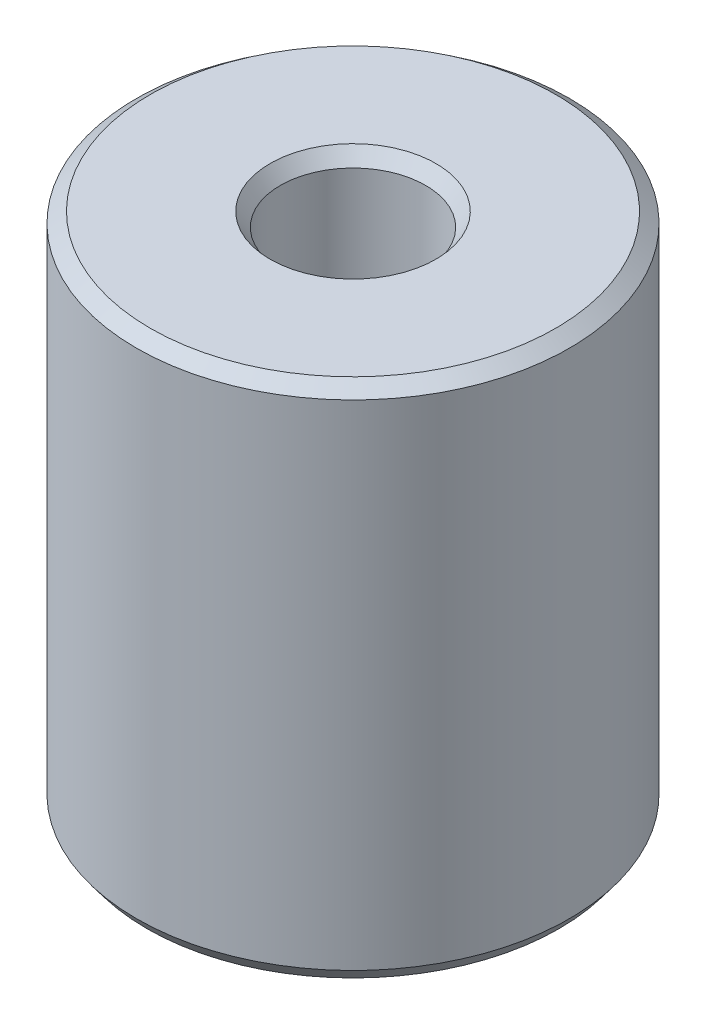
ISO-10303-21;
HEADER;
FILE_DESCRIPTION(('STEP AP214'),'2;1');
FILE_NAME('part.step','',(''),(''),'','','');
FILE_SCHEMA(('AUTOMOTIVE_DESIGN { 1 0 10303 214 1 1 1 1 }'));
ENDSEC;
DATA;
#1=APPLICATION_CONTEXT('core data for automotive mechanical design processes');
#2=APPLICATION_PROTOCOL_DEFINITION('international standard','automotive_design',2000,#1);
#3=PRODUCT_CONTEXT('',#1,'mechanical');
#4=PRODUCT('Part','Part','',(#3));
#5=PRODUCT_RELATED_PRODUCT_CATEGORY('part','',(#4));
#6=PRODUCT_DEFINITION_FORMATION('','',#4);
#7=PRODUCT_DEFINITION_CONTEXT('part definition',#1,'design');
#8=PRODUCT_DEFINITION('design','',#6,#7);
#9=PRODUCT_DEFINITION_SHAPE('','',#8);
#10=(LENGTH_UNIT() NAMED_UNIT(*) SI_UNIT(.MILLI.,.METRE.));
#11=(NAMED_UNIT(*) PLANE_ANGLE_UNIT() SI_UNIT($,.RADIAN.));
#12=(NAMED_UNIT(*) SI_UNIT($,.STERADIAN.) SOLID_ANGLE_UNIT());
#13=UNCERTAINTY_MEASURE_WITH_UNIT(LENGTH_MEASURE(1.E-05),#10,'distance_accuracy_value','');
#14=(GEOMETRIC_REPRESENTATION_CONTEXT(3) GLOBAL_UNCERTAINTY_ASSIGNED_CONTEXT((#13)) GLOBAL_UNIT_ASSIGNED_CONTEXT((#10,
#11,#12)) REPRESENTATION_CONTEXT('',''));
#15=CARTESIAN_POINT('',(0.,0.,0.));
#16=DIRECTION('',(0.,0.,1.));
#17=DIRECTION('',(1.,0.,0.));
#18=AXIS2_PLACEMENT_3D('',#15,#16,#17);
#19=CARTESIAN_POINT('',(0.,23.9436677280948,0.));
#20=DIRECTION('',(0.,-1.,0.));
#21=DIRECTION('',(0.,0.,-1.));
#22=AXIS2_PLACEMENT_3D('',#19,#20,#21);
#23=CYLINDRICAL_SURFACE('',#22,10.);
#24=CARTESIAN_POINT('',(0.,0.637220412219568,0.));
#25=DIRECTION('',(0.,1.,0.));
#26=DIRECTION('',(0.,0.,1.));
#27=AXIS2_PLACEMENT_3D('',#24,#25,#26);
#28=CIRCLE('',#27,10.);
#29=CARTESIAN_POINT('',(0.,0.637220412219568,10.));
#30=VERTEX_POINT('',#29);
#31=EDGE_CURVE('E10',#30,#30,#28,.T.);
#32=ORIENTED_EDGE('',*,*,#31,.T.);
#33=EDGE_LOOP('',(#32));
#34=FACE_BOUND('',#33,.T.);
#35=CARTESIAN_POINT('',(0.,23.466955404122,0.));
#36=DIRECTION('',(0.,1.,0.));
#37=DIRECTION('',(0.,0.,1.));
#38=AXIS2_PLACEMENT_3D('',#35,#36,#37);
#39=CIRCLE('',#38,10.);
#40=CARTESIAN_POINT('',(0.,23.466955404122,10.));
#41=VERTEX_POINT('',#40);
#42=EDGE_CURVE('E50',#41,#41,#39,.F.);
#43=ORIENTED_EDGE('',*,*,#42,.T.);
#44=EDGE_LOOP('',(#43));
#45=FACE_BOUND('',#44,.T.);
#46=ADVANCED_FACE('F39',(#34,#45),#23,.T.);
#47=CARTESIAN_POINT('',(0.,23.9436677280948,0.));
#48=DIRECTION('',(0.,1.,0.));
#49=DIRECTION('',(0.,0.,1.));
#50=AXIS2_PLACEMENT_3D('',#47,#48,#49);
#51=PLANE('',#50);
#52=CARTESIAN_POINT('',(0.,23.9436677280948,0.));
#53=DIRECTION('',(0.,1.,0.));
#54=DIRECTION('',(0.,0.,1.));
#55=AXIS2_PLACEMENT_3D('',#52,#53,#54);
#56=CIRCLE('',#55,3.83300768559892);
#57=CARTESIAN_POINT('',(0.,23.9436677280948,3.83300768559892));
#58=VERTEX_POINT('',#57);
#59=EDGE_CURVE('E58',#58,#58,#56,.F.);
#60=ORIENTED_EDGE('',*,*,#59,.T.);
#61=EDGE_LOOP('',(#60));
#62=FACE_BOUND('',#61,.T.);
#63=CARTESIAN_POINT('',(0.,23.9436677280948,0.));
#64=DIRECTION('',(0.,1.,0.));
#65=DIRECTION('',(0.,0.,1.));
#66=AXIS2_PLACEMENT_3D('',#63,#64,#65);
#67=CIRCLE('',#66,9.36277958778044);
#68=CARTESIAN_POINT('',(0.,23.9436677280948,9.36277958778044));
#69=VERTEX_POINT('',#68);
#70=EDGE_CURVE('E61',#69,#69,#67,.T.);
#71=ORIENTED_EDGE('',*,*,#70,.T.);
#72=EDGE_LOOP('',(#71));
#73=FACE_BOUND('',#72,.T.);
#74=ADVANCED_FACE('F88',(#62,#73),#51,.T.);
#75=CARTESIAN_POINT('',(0.,0.,0.));
#76=DIRECTION('',(0.,1.,0.));
#77=DIRECTION('',(0.,0.,1.));
#78=AXIS2_PLACEMENT_3D('',#75,#76,#77);
#79=PLANE('',#78);
#80=CARTESIAN_POINT('',(0.,0.,0.));
#81=DIRECTION('',(0.,1.,0.));
#82=DIRECTION('',(0.,0.,1.));
#83=AXIS2_PLACEMENT_3D('',#80,#81,#82);
#84=CIRCLE('',#83,3.99351577384568);
#85=CARTESIAN_POINT('',(0.,0.,3.99351577384568));
#86=VERTEX_POINT('',#85);
#87=EDGE_CURVE('E51',#86,#86,#84,.T.);
#88=ORIENTED_EDGE('',*,*,#87,.T.);
#89=EDGE_LOOP('',(#88));
#90=FACE_BOUND('',#89,.T.);
#91=CARTESIAN_POINT('',(0.,0.,0.));
#92=DIRECTION('',(0.,1.,0.));
#93=DIRECTION('',(0.,0.,1.));
#94=AXIS2_PLACEMENT_3D('',#91,#92,#93);
#95=CIRCLE('',#94,9.52328767602719);
#96=CARTESIAN_POINT('',(0.,0.,9.52328767602719));
#97=VERTEX_POINT('',#96);
#98=EDGE_CURVE('E54',#97,#97,#95,.F.);
#99=ORIENTED_EDGE('',*,*,#98,.T.);
#100=EDGE_LOOP('',(#99));
#101=FACE_BOUND('',#100,.T.);
#102=ADVANCED_FACE('F83',(#90,#101),#79,.F.);
#103=CARTESIAN_POINT('',(0.,23.9436677280948,0.));
#104=DIRECTION('',(0.,-1.,0.));
#105=DIRECTION('',(0.,0.,-1.));
#106=AXIS2_PLACEMENT_3D('',#103,#104,#105);
#107=CYLINDRICAL_SURFACE('',#106,3.35629536162611);
#108=CARTESIAN_POINT('',(0.,23.3064473158753,0.));
#109=DIRECTION('',(0.,1.,0.));
#110=DIRECTION('',(0.,0.,1.));
#111=AXIS2_PLACEMENT_3D('',#108,#109,#110);
#112=CIRCLE('',#111,3.35629536162611);
#113=CARTESIAN_POINT('',(0.,23.3064473158753,3.35629536162611));
#114=VERTEX_POINT('',#113);
#115=EDGE_CURVE('E67',#114,#114,#112,.T.);
#116=ORIENTED_EDGE('',*,*,#115,.T.);
#117=EDGE_LOOP('',(#116));
#118=FACE_BOUND('',#117,.T.);
#119=CARTESIAN_POINT('',(0.,0.476712323972814,0.));
#120=DIRECTION('',(0.,1.,0.));
#121=DIRECTION('',(0.,0.,1.));
#122=AXIS2_PLACEMENT_3D('',#119,#120,#121);
#123=CIRCLE('',#122,3.35629536162611);
#124=CARTESIAN_POINT('',(0.,0.476712323972814,3.35629536162611));
#125=VERTEX_POINT('',#124);
#126=EDGE_CURVE('E69',#125,#125,#123,.F.);
#127=ORIENTED_EDGE('',*,*,#126,.T.);
#128=EDGE_LOOP('',(#127));
#129=FACE_BOUND('',#128,.T.);
#130=ADVANCED_FACE('F71',(#118,#129),#107,.F.);
#131=CARTESIAN_POINT('',(0.,23.3064473158753,0.));
#132=DIRECTION('',(0.,1.,0.));
#133=DIRECTION('',(0.,0.,1.));
#134=AXIS2_PLACEMENT_3D('',#131,#132,#133);
#135=CONICAL_SURFACE('',#134,3.35629536162611,0.642291780845801);
#136=ORIENTED_EDGE('',*,*,#59,.F.);
#137=EDGE_LOOP('',(#136));
#138=FACE_BOUND('',#137,.T.);
#139=ORIENTED_EDGE('',*,*,#115,.F.);
#140=EDGE_LOOP('',(#139));
#141=FACE_BOUND('',#140,.T.);
#142=ADVANCED_FACE('F77',(#138,#141),#135,.F.);
#143=CARTESIAN_POINT('',(0.,0.,0.));
#144=DIRECTION('',(0.,-1.,0.));
#145=DIRECTION('',(0.,0.,-1.));
#146=AXIS2_PLACEMENT_3D('',#143,#144,#145);
#147=CONICAL_SURFACE('',#146,3.99351577384568,0.928504545949093);
#148=ORIENTED_EDGE('',*,*,#126,.F.);
#149=EDGE_LOOP('',(#148));
#150=FACE_BOUND('',#149,.T.);
#151=ORIENTED_EDGE('',*,*,#87,.F.);
#152=EDGE_LOOP('',(#151));
#153=FACE_BOUND('',#152,.T.);
#154=ADVANCED_FACE('F73',(#150,#153),#147,.F.);
#155=CARTESIAN_POINT('',(0.,0.637220412219568,0.));
#156=DIRECTION('',(0.,1.,0.));
#157=DIRECTION('',(0.,0.,1.));
#158=AXIS2_PLACEMENT_3D('',#155,#156,#157);
#159=CONICAL_SURFACE('',#158,10.,0.642291780845806);
#160=ORIENTED_EDGE('',*,*,#98,.F.);
#161=EDGE_LOOP('',(#160));
#162=FACE_BOUND('',#161,.T.);
#163=ORIENTED_EDGE('',*,*,#31,.F.);
#164=EDGE_LOOP('',(#163));
#165=FACE_BOUND('',#164,.T.);
#166=ADVANCED_FACE('F76',(#162,#165),#159,.T.);
#167=CARTESIAN_POINT('',(0.,23.9436677280948,0.));
#168=DIRECTION('',(0.,-1.,0.));
#169=DIRECTION('',(0.,0.,-1.));
#170=AXIS2_PLACEMENT_3D('',#167,#168,#169);
#171=CONICAL_SURFACE('',#170,9.36277958778044,0.928504545949086);
#172=ORIENTED_EDGE('',*,*,#42,.F.);
#173=EDGE_LOOP('',(#172));
#174=FACE_BOUND('',#173,.T.);
#175=ORIENTED_EDGE('',*,*,#70,.F.);
#176=EDGE_LOOP('',(#175));
#177=FACE_BOUND('',#176,.T.);
#178=ADVANCED_FACE('F45',(#174,#177),#171,.T.);
#179=CLOSED_SHELL('',(#46,#74,#102,#130,#142,#154,#166,#178));
#180=MANIFOLD_SOLID_BREP('B2',#179);
#181=ADVANCED_BREP_SHAPE_REPRESENTATION('',(#18,#180),#14);
#182=SHAPE_DEFINITION_REPRESENTATION(#9,#181);
ENDSEC;
END-ISO-10303-21;
